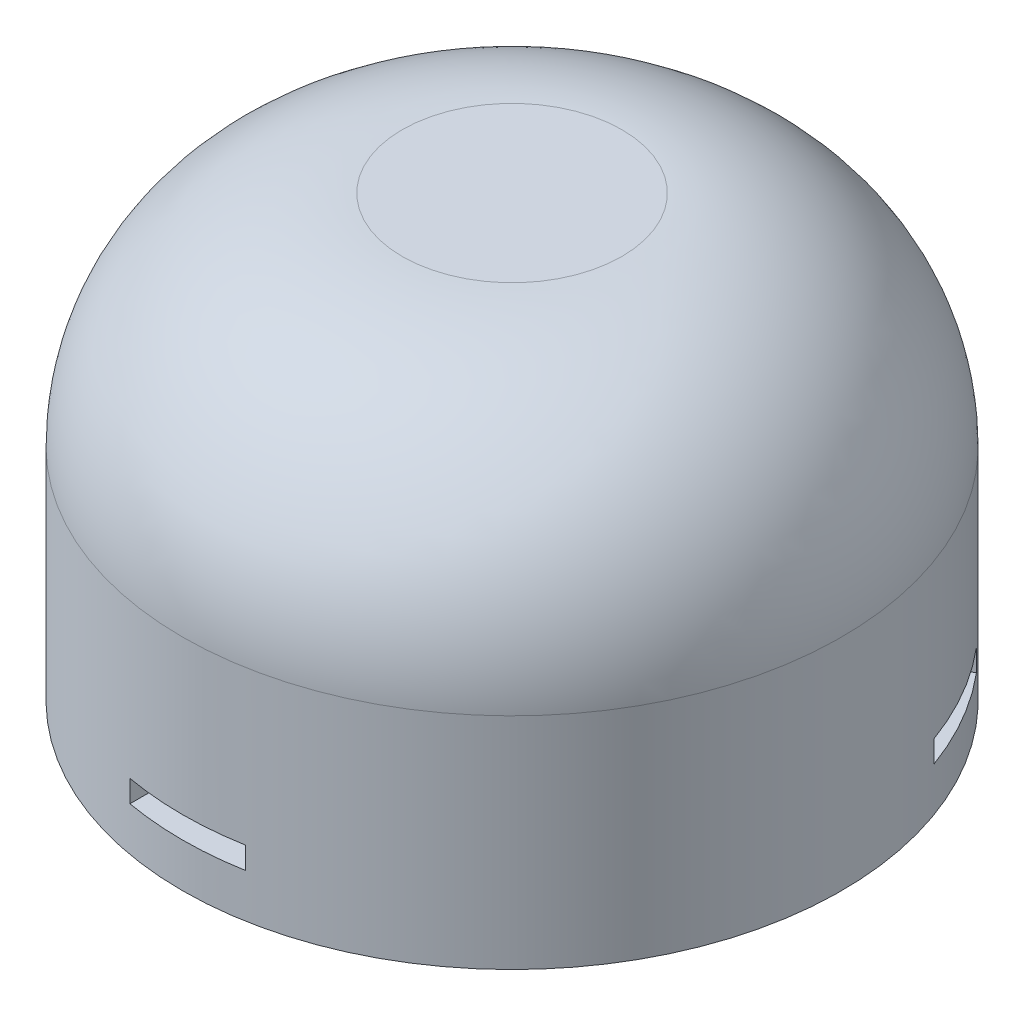
ISO-10303-21;
HEADER;
FILE_DESCRIPTION(('STEP AP214'),'2;1');
FILE_NAME('part.step','',(''),(''),'','','');
FILE_SCHEMA(('AUTOMOTIVE_DESIGN { 1 0 10303 214 1 1 1 1 }'));
ENDSEC;
DATA;
#1=APPLICATION_CONTEXT('core data for automotive mechanical design processes');
#2=APPLICATION_PROTOCOL_DEFINITION('international standard','automotive_design',2000,#1);
#3=PRODUCT_CONTEXT('',#1,'mechanical');
#4=PRODUCT('Part','Part','',(#3));
#5=PRODUCT_RELATED_PRODUCT_CATEGORY('part','',(#4));
#6=PRODUCT_DEFINITION_FORMATION('','',#4);
#7=PRODUCT_DEFINITION_CONTEXT('part definition',#1,'design');
#8=PRODUCT_DEFINITION('design','',#6,#7);
#9=PRODUCT_DEFINITION_SHAPE('','',#8);
#10=(LENGTH_UNIT() NAMED_UNIT(*) SI_UNIT(.MILLI.,.METRE.));
#11=(NAMED_UNIT(*) PLANE_ANGLE_UNIT() SI_UNIT($,.RADIAN.));
#12=(NAMED_UNIT(*) SI_UNIT($,.STERADIAN.) SOLID_ANGLE_UNIT());
#13=UNCERTAINTY_MEASURE_WITH_UNIT(LENGTH_MEASURE(1.E-05),#10,'distance_accuracy_value','');
#14=(GEOMETRIC_REPRESENTATION_CONTEXT(3) GLOBAL_UNCERTAINTY_ASSIGNED_CONTEXT((#13)) GLOBAL_UNIT_ASSIGNED_CONTEXT((#10,
#11,#12)) REPRESENTATION_CONTEXT('',''));
#15=CARTESIAN_POINT('',(0.,0.,0.));
#16=DIRECTION('',(0.,0.,1.));
#17=DIRECTION('',(1.,0.,0.));
#18=AXIS2_PLACEMENT_3D('',#15,#16,#17);
#19=CARTESIAN_POINT('',(0.,20.,0.));
#20=DIRECTION('',(0.,-1.,0.));
#21=DIRECTION('',(0.,0.,-1.));
#22=AXIS2_PLACEMENT_3D('',#19,#20,#21);
#23=CYLINDRICAL_SURFACE('',#22,15.);
#24=CARTESIAN_POINT('',(0.,2.,0.));
#25=DIRECTION('',(0.,-1.,0.));
#26=DIRECTION('',(0.,0.,-1.));
#27=AXIS2_PLACEMENT_3D('',#24,#25,#26);
#28=CIRCLE('',#27,15.);
#29=CARTESIAN_POINT('',(-14.1024191260148,2.,-5.11094656538412));
#30=VERTEX_POINT('',#29);
#31=CARTESIAN_POINT('',(-11.4774191260148,2.,-9.65757993525241));
#32=VERTEX_POINT('',#31);
#33=EDGE_CURVE('E277',#30,#32,#28,.T.);
#34=ORIENTED_EDGE('',*,*,#33,.T.);
#35=DIRECTION('',(0.,-1.,0.));
#36=VECTOR('',#35,1.);
#37=CARTESIAN_POINT('',(-11.4774191260148,20.,-9.65757993525241));
#38=LINE('',#37,#36);
#39=CARTESIAN_POINT('',(-11.4774191260148,3.,-9.65757993525241));
#40=VERTEX_POINT('',#39);
#41=EDGE_CURVE('E11',#32,#40,#38,.F.);
#42=ORIENTED_EDGE('',*,*,#41,.T.);
#43=CARTESIAN_POINT('',(0.,3.,0.));
#44=DIRECTION('',(0.,1.,0.));
#45=DIRECTION('',(0.,0.,1.));
#46=AXIS2_PLACEMENT_3D('',#43,#44,#45);
#47=CIRCLE('',#46,15.);
#48=CARTESIAN_POINT('',(-14.1024191260148,3.,-5.11094656538412));
#49=VERTEX_POINT('',#48);
#50=EDGE_CURVE('E54',#40,#49,#47,.T.);
#51=ORIENTED_EDGE('',*,*,#50,.T.);
#52=DIRECTION('',(0.,-1.,0.));
#53=VECTOR('',#52,1.);
#54=CARTESIAN_POINT('',(-14.1024191260148,20.,-5.11094656538412));
#55=LINE('',#54,#53);
#56=EDGE_CURVE('E280',#49,#30,#55,.T.);
#57=ORIENTED_EDGE('',*,*,#56,.T.);
#58=EDGE_LOOP('',(#34,#42,#51,#57));
#59=FACE_BOUND('',#58,.T.);
#60=CARTESIAN_POINT('',(0.,2.,0.));
#61=DIRECTION('',(0.,-1.,0.));
#62=DIRECTION('',(0.,0.,-1.));
#63=AXIS2_PLACEMENT_3D('',#60,#61,#62);
#64=CIRCLE('',#63,15.);
#65=CARTESIAN_POINT('',(11.4774191260149,2.,-9.65757993525225));
#66=VERTEX_POINT('',#65);
#67=CARTESIAN_POINT('',(14.1024191260149,2.,-5.11094656538392));
#68=VERTEX_POINT('',#67);
#69=EDGE_CURVE('E261',#66,#68,#64,.T.);
#70=ORIENTED_EDGE('',*,*,#69,.T.);
#71=DIRECTION('',(0.,-1.,0.));
#72=VECTOR('',#71,1.);
#73=CARTESIAN_POINT('',(14.1024191260149,20.,-5.11094656538392));
#74=LINE('',#73,#72);
#75=CARTESIAN_POINT('',(14.1024191260149,3.,-5.11094656538392));
#76=VERTEX_POINT('',#75);
#77=EDGE_CURVE('E273',#68,#76,#74,.F.);
#78=ORIENTED_EDGE('',*,*,#77,.T.);
#79=CARTESIAN_POINT('',(0.,3.,0.));
#80=DIRECTION('',(0.,1.,0.));
#81=DIRECTION('',(0.,0.,1.));
#82=AXIS2_PLACEMENT_3D('',#79,#80,#81);
#83=CIRCLE('',#82,15.);
#84=CARTESIAN_POINT('',(11.4774191260149,3.,-9.65757993525225));
#85=VERTEX_POINT('',#84);
#86=EDGE_CURVE('E269',#76,#85,#83,.T.);
#87=ORIENTED_EDGE('',*,*,#86,.T.);
#88=DIRECTION('',(0.,-1.,0.));
#89=VECTOR('',#88,1.);
#90=CARTESIAN_POINT('',(11.4774191260149,20.,-9.65757993525225));
#91=LINE('',#90,#89);
#92=EDGE_CURVE('E265',#85,#66,#91,.T.);
#93=ORIENTED_EDGE('',*,*,#92,.T.);
#94=EDGE_LOOP('',(#70,#78,#87,#93));
#95=FACE_BOUND('',#94,.T.);
#96=CARTESIAN_POINT('',(0.,2.,0.));
#97=DIRECTION('',(0.,-1.,0.));
#98=DIRECTION('',(1.,0.,0.));
#99=AXIS2_PLACEMENT_3D('',#96,#97,#98);
#100=CIRCLE('',#99,15.);
#101=CARTESIAN_POINT('',(2.625,2.,14.7685265006364));
#102=VERTEX_POINT('',#101);
#103=CARTESIAN_POINT('',(-2.625,2.,14.7685265006364));
#104=VERTEX_POINT('',#103);
#105=EDGE_CURVE('E245',#102,#104,#100,.T.);
#106=ORIENTED_EDGE('',*,*,#105,.T.);
#107=DIRECTION('',(0.,-1.,0.));
#108=VECTOR('',#107,1.);
#109=CARTESIAN_POINT('',(-2.625,20.,14.7685265006364));
#110=LINE('',#109,#108);
#111=CARTESIAN_POINT('',(-2.625,3.,14.7685265006364));
#112=VERTEX_POINT('',#111);
#113=EDGE_CURVE('E257',#104,#112,#110,.F.);
#114=ORIENTED_EDGE('',*,*,#113,.T.);
#115=CARTESIAN_POINT('',(0.,3.,0.));
#116=DIRECTION('',(0.,1.,0.));
#117=DIRECTION('',(-1.,0.,0.));
#118=AXIS2_PLACEMENT_3D('',#115,#116,#117);
#119=CIRCLE('',#118,15.);
#120=CARTESIAN_POINT('',(2.625,3.,14.7685265006364));
#121=VERTEX_POINT('',#120);
#122=EDGE_CURVE('E253',#112,#121,#119,.T.);
#123=ORIENTED_EDGE('',*,*,#122,.T.);
#124=DIRECTION('',(0.,-1.,0.));
#125=VECTOR('',#124,1.);
#126=CARTESIAN_POINT('',(2.625,20.,14.7685265006364));
#127=LINE('',#126,#125);
#128=EDGE_CURVE('E249',#121,#102,#127,.T.);
#129=ORIENTED_EDGE('',*,*,#128,.T.);
#130=EDGE_LOOP('',(#106,#114,#123,#129));
#131=FACE_BOUND('',#130,.T.);
#132=CARTESIAN_POINT('',(0.,10.,0.));
#133=DIRECTION('',(0.,1.,0.));
#134=DIRECTION('',(0.,0.,1.));
#135=AXIS2_PLACEMENT_3D('',#132,#133,#134);
#136=CIRCLE('',#135,15.);
#137=CARTESIAN_POINT('',(0.,10.,15.));
#138=VERTEX_POINT('',#137);
#139=EDGE_CURVE('E241',#138,#138,#136,.F.);
#140=ORIENTED_EDGE('',*,*,#139,.T.);
#141=EDGE_LOOP('',(#140));
#142=FACE_BOUND('',#141,.T.);
#143=CARTESIAN_POINT('',(0.,0.,0.));
#144=DIRECTION('',(0.,1.,0.));
#145=DIRECTION('',(0.,0.,1.));
#146=AXIS2_PLACEMENT_3D('',#143,#144,#145);
#147=CIRCLE('',#146,15.);
#148=CARTESIAN_POINT('',(0.,0.,15.));
#149=VERTEX_POINT('',#148);
#150=EDGE_CURVE('E223',#149,#149,#147,.T.);
#151=ORIENTED_EDGE('',*,*,#150,.T.);
#152=EDGE_LOOP('',(#151));
#153=FACE_BOUND('',#152,.T.);
#154=ADVANCED_FACE('F45',(#59,#95,#131,#142,#153),#23,.T.);
#155=CARTESIAN_POINT('',(0.,20.,0.));
#156=DIRECTION('',(0.,1.,0.));
#157=DIRECTION('',(0.,0.,1.));
#158=AXIS2_PLACEMENT_3D('',#155,#156,#157);
#159=PLANE('',#158);
#160=CARTESIAN_POINT('',(0.,20.,0.));
#161=DIRECTION('',(0.,1.,0.));
#162=DIRECTION('',(0.,0.,1.));
#163=AXIS2_PLACEMENT_3D('',#160,#161,#162);
#164=CIRCLE('',#163,5.);
#165=CARTESIAN_POINT('',(0.,20.,5.));
#166=VERTEX_POINT('',#165);
#167=EDGE_CURVE('E237',#166,#166,#164,.T.);
#168=ORIENTED_EDGE('',*,*,#167,.T.);
#169=EDGE_LOOP('',(#168));
#170=FACE_BOUND('',#169,.T.);
#171=ADVANCED_FACE('F300',(#170),#159,.T.);
#172=CARTESIAN_POINT('',(0.,0.,0.));
#173=DIRECTION('',(0.,1.,0.));
#174=DIRECTION('',(0.,0.,1.));
#175=AXIS2_PLACEMENT_3D('',#172,#173,#174);
#176=PLANE('',#175);
#177=ORIENTED_EDGE('',*,*,#150,.F.);
#178=EDGE_LOOP('',(#177));
#179=FACE_BOUND('',#178,.T.);
#180=ADVANCED_FACE('F306',(#179),#176,.F.);
#181=CARTESIAN_POINT('',(0.,10.,0.));
#182=DIRECTION('',(0.,1.,0.));
#183=DIRECTION('',(0.,0.,1.));
#184=AXIS2_PLACEMENT_3D('',#181,#182,#183);
#185=DEGENERATE_TOROIDAL_SURFACE('',#184,5.,10.,.T.);
#186=ORIENTED_EDGE('',*,*,#139,.F.);
#187=EDGE_LOOP('',(#186));
#188=FACE_BOUND('',#187,.T.);
#189=ORIENTED_EDGE('',*,*,#167,.F.);
#190=EDGE_LOOP('',(#189));
#191=FACE_BOUND('',#190,.T.);
#192=ADVANCED_FACE('F47',(#188,#191),#185,.T.);
#193=CARTESIAN_POINT('',(-2.625,2.,10.));
#194=DIRECTION('',(-1.,0.,0.));
#195=DIRECTION('',(0.,0.,1.));
#196=AXIS2_PLACEMENT_3D('',#193,#194,#195);
#197=PLANE('',#196);
#198=DIRECTION('',(0.,0.,1.));
#199=VECTOR('',#198,1.);
#200=CARTESIAN_POINT('',(-2.625,2.,10.));
#201=LINE('',#200,#199);
#202=CARTESIAN_POINT('',(-2.625,2.,10.));
#203=VERTEX_POINT('',#202);
#204=EDGE_CURVE('E218',#203,#104,#201,.T.);
#205=ORIENTED_EDGE('',*,*,#204,.F.);
#206=DIRECTION('',(0.,-1.,0.));
#207=VECTOR('',#206,1.);
#208=CARTESIAN_POINT('',(-2.625,2.,10.));
#209=LINE('',#208,#207);
#210=CARTESIAN_POINT('',(-2.625,3.,10.));
#211=VERTEX_POINT('',#210);
#212=EDGE_CURVE('E171',#211,#203,#209,.T.);
#213=ORIENTED_EDGE('',*,*,#212,.F.);
#214=DIRECTION('',(0.,0.,1.));
#215=VECTOR('',#214,1.);
#216=CARTESIAN_POINT('',(-2.625,3.,10.));
#217=LINE('',#216,#215);
#218=EDGE_CURVE('E219',#211,#112,#217,.T.);
#219=ORIENTED_EDGE('',*,*,#218,.T.);
#220=ORIENTED_EDGE('',*,*,#113,.F.);
#221=EDGE_LOOP('',(#205,#213,#219,#220));
#222=FACE_BOUND('',#221,.T.);
#223=ADVANCED_FACE('F313',(#222),#197,.F.);
#224=CARTESIAN_POINT('',(-2.625,3.,10.));
#225=DIRECTION('',(0.,1.,0.));
#226=DIRECTION('',(-1.,0.,0.));
#227=AXIS2_PLACEMENT_3D('',#224,#225,#226);
#228=PLANE('',#227);
#229=ORIENTED_EDGE('',*,*,#218,.F.);
#230=DIRECTION('',(-1.,0.,0.));
#231=VECTOR('',#230,1.);
#232=CARTESIAN_POINT('',(-2.625,3.,10.));
#233=LINE('',#232,#231);
#234=CARTESIAN_POINT('',(2.625,3.,10.));
#235=VERTEX_POINT('',#234);
#236=EDGE_CURVE('E214',#235,#211,#233,.T.);
#237=ORIENTED_EDGE('',*,*,#236,.F.);
#238=DIRECTION('',(0.,0.,1.));
#239=VECTOR('',#238,1.);
#240=CARTESIAN_POINT('',(2.625,3.,10.));
#241=LINE('',#240,#239);
#242=EDGE_CURVE('E224',#235,#121,#241,.T.);
#243=ORIENTED_EDGE('',*,*,#242,.T.);
#244=ORIENTED_EDGE('',*,*,#122,.F.);
#245=EDGE_LOOP('',(#229,#237,#243,#244));
#246=FACE_BOUND('',#245,.T.);
#247=ADVANCED_FACE('F316',(#246),#228,.F.);
#248=CARTESIAN_POINT('',(2.625,2.,10.));
#249=DIRECTION('',(1.,0.,0.));
#250=DIRECTION('',(0.,0.,-1.));
#251=AXIS2_PLACEMENT_3D('',#248,#249,#250);
#252=PLANE('',#251);
#253=ORIENTED_EDGE('',*,*,#242,.F.);
#254=DIRECTION('',(0.,1.,0.));
#255=VECTOR('',#254,1.);
#256=CARTESIAN_POINT('',(2.625,2.,10.));
#257=LINE('',#256,#255);
#258=CARTESIAN_POINT('',(2.625,2.,10.));
#259=VERTEX_POINT('',#258);
#260=EDGE_CURVE('E210',#259,#235,#257,.T.);
#261=ORIENTED_EDGE('',*,*,#260,.F.);
#262=DIRECTION('',(0.,0.,1.));
#263=VECTOR('',#262,1.);
#264=CARTESIAN_POINT('',(2.625,2.,10.));
#265=LINE('',#264,#263);
#266=EDGE_CURVE('E228',#259,#102,#265,.T.);
#267=ORIENTED_EDGE('',*,*,#266,.T.);
#268=ORIENTED_EDGE('',*,*,#128,.F.);
#269=EDGE_LOOP('',(#253,#261,#267,#268));
#270=FACE_BOUND('',#269,.T.);
#271=ADVANCED_FACE('F322',(#270),#252,.F.);
#272=CARTESIAN_POINT('',(-2.625,2.,10.));
#273=DIRECTION('',(0.,-1.,0.));
#274=DIRECTION('',(1.,0.,0.));
#275=AXIS2_PLACEMENT_3D('',#272,#273,#274);
#276=PLANE('',#275);
#277=ORIENTED_EDGE('',*,*,#266,.F.);
#278=DIRECTION('',(1.,0.,0.));
#279=VECTOR('',#278,1.);
#280=CARTESIAN_POINT('',(-2.625,2.,10.));
#281=LINE('',#280,#279);
#282=EDGE_CURVE('E206',#203,#259,#281,.T.);
#283=ORIENTED_EDGE('',*,*,#282,.F.);
#284=ORIENTED_EDGE('',*,*,#204,.T.);
#285=ORIENTED_EDGE('',*,*,#105,.F.);
#286=EDGE_LOOP('',(#277,#283,#284,#285));
#287=FACE_BOUND('',#286,.T.);
#288=ADVANCED_FACE('F318',(#287),#276,.F.);
#289=CARTESIAN_POINT('',(0.,0.,10.));
#290=DIRECTION('',(0.,0.,-1.));
#291=DIRECTION('',(-1.,0.,0.));
#292=AXIS2_PLACEMENT_3D('',#289,#290,#291);
#293=PLANE('',#292);
#294=ORIENTED_EDGE('',*,*,#212,.T.);
#295=ORIENTED_EDGE('',*,*,#282,.T.);
#296=ORIENTED_EDGE('',*,*,#260,.T.);
#297=ORIENTED_EDGE('',*,*,#236,.T.);
#298=EDGE_LOOP('',(#294,#295,#296,#297));
#299=FACE_BOUND('',#298,.T.);
#300=ADVANCED_FACE('F321',(#299),#293,.F.);
#301=CARTESIAN_POINT('',(9.97275403784442,2.,-2.72668331506576));
#302=DIRECTION('',(0.499999999999992,0.,0.866025403784443));
#303=DIRECTION('',(0.866025403784443,0.,-0.499999999999992));
#304=AXIS2_PLACEMENT_3D('',#301,#302,#303);
#305=PLANE('',#304);
#306=DIRECTION('',(0.866025403784443,0.,-0.499999999999992));
#307=VECTOR('',#306,1.);
#308=CARTESIAN_POINT('',(9.97275403784442,2.,-2.72668331506576));
#309=LINE('',#308,#307);
#310=CARTESIAN_POINT('',(9.97275403784442,2.,-2.72668331506576));
#311=VERTEX_POINT('',#310);
#312=EDGE_CURVE('E69',#311,#68,#309,.T.);
#313=ORIENTED_EDGE('',*,*,#312,.F.);
#314=DIRECTION('',(0.,-1.,0.));
#315=VECTOR('',#314,1.);
#316=CARTESIAN_POINT('',(9.97275403784442,2.,-2.72668331506576));
#317=LINE('',#316,#315);
#318=CARTESIAN_POINT('',(9.97275403784442,3.,-2.72668331506576));
#319=VERTEX_POINT('',#318);
#320=EDGE_CURVE('E178',#319,#311,#317,.T.);
#321=ORIENTED_EDGE('',*,*,#320,.F.);
#322=DIRECTION('',(0.866025403784443,0.,-0.499999999999992));
#323=VECTOR('',#322,1.);
#324=CARTESIAN_POINT('',(9.97275403784442,3.,-2.72668331506576));
#325=LINE('',#324,#323);
#326=EDGE_CURVE('E157',#319,#76,#325,.T.);
#327=ORIENTED_EDGE('',*,*,#326,.T.);
#328=ORIENTED_EDGE('',*,*,#77,.F.);
#329=EDGE_LOOP('',(#313,#321,#327,#328));
#330=FACE_BOUND('',#329,.T.);
#331=ADVANCED_FACE('F331',(#330),#305,.F.);
#332=CARTESIAN_POINT('',(9.97275403784442,3.,-2.72668331506576));
#333=DIRECTION('',(0.,1.,0.));
#334=DIRECTION('',(0.,0.,1.));
#335=AXIS2_PLACEMENT_3D('',#332,#333,#334);
#336=PLANE('',#335);
#337=ORIENTED_EDGE('',*,*,#326,.F.);
#338=DIRECTION('',(0.499999999999992,0.,0.866025403784443));
#339=VECTOR('',#338,1.);
#340=CARTESIAN_POINT('',(9.97275403784442,3.,-2.72668331506576));
#341=LINE('',#340,#339);
#342=CARTESIAN_POINT('',(7.34775403784445,3.,-7.27331668493408));
#343=VERTEX_POINT('',#342);
#344=EDGE_CURVE('E190',#343,#319,#341,.T.);
#345=ORIENTED_EDGE('',*,*,#344,.F.);
#346=DIRECTION('',(0.866025403784443,0.,-0.499999999999992));
#347=VECTOR('',#346,1.);
#348=CARTESIAN_POINT('',(7.34775403784445,3.,-7.27331668493408));
#349=LINE('',#348,#347);
#350=EDGE_CURVE('E161',#343,#85,#349,.T.);
#351=ORIENTED_EDGE('',*,*,#350,.T.);
#352=ORIENTED_EDGE('',*,*,#86,.F.);
#353=EDGE_LOOP('',(#337,#345,#351,#352));
#354=FACE_BOUND('',#353,.T.);
#355=ADVANCED_FACE('F334',(#354),#336,.F.);
#356=CARTESIAN_POINT('',(7.34775403784445,2.,-7.27331668493408));
#357=DIRECTION('',(-0.499999999999992,0.,-0.866025403784443));
#358=DIRECTION('',(-0.866025403784443,0.,0.499999999999992));
#359=AXIS2_PLACEMENT_3D('',#356,#357,#358);
#360=PLANE('',#359);
#361=ORIENTED_EDGE('',*,*,#350,.F.);
#362=DIRECTION('',(0.,1.,0.));
#363=VECTOR('',#362,1.);
#364=CARTESIAN_POINT('',(7.34775403784445,2.,-7.27331668493408));
#365=LINE('',#364,#363);
#366=CARTESIAN_POINT('',(7.34775403784445,2.,-7.27331668493408));
#367=VERTEX_POINT('',#366);
#368=EDGE_CURVE('E186',#367,#343,#365,.T.);
#369=ORIENTED_EDGE('',*,*,#368,.F.);
#370=DIRECTION('',(0.866025403784443,0.,-0.499999999999992));
#371=VECTOR('',#370,1.);
#372=CARTESIAN_POINT('',(7.34775403784445,2.,-7.27331668493408));
#373=LINE('',#372,#371);
#374=EDGE_CURVE('E197',#367,#66,#373,.T.);
#375=ORIENTED_EDGE('',*,*,#374,.T.);
#376=ORIENTED_EDGE('',*,*,#92,.F.);
#377=EDGE_LOOP('',(#361,#369,#375,#376));
#378=FACE_BOUND('',#377,.T.);
#379=ADVANCED_FACE('F340',(#378),#360,.F.);
#380=CARTESIAN_POINT('',(9.97275403784442,2.,-2.72668331506576));
#381=DIRECTION('',(0.,-1.,0.));
#382=DIRECTION('',(0.,0.,-1.));
#383=AXIS2_PLACEMENT_3D('',#380,#381,#382);
#384=PLANE('',#383);
#385=ORIENTED_EDGE('',*,*,#374,.F.);
#386=DIRECTION('',(-0.499999999999992,0.,-0.866025403784443));
#387=VECTOR('',#386,1.);
#388=CARTESIAN_POINT('',(9.97275403784442,2.,-2.72668331506576));
#389=LINE('',#388,#387);
#390=EDGE_CURVE('E182',#311,#367,#389,.T.);
#391=ORIENTED_EDGE('',*,*,#390,.F.);
#392=ORIENTED_EDGE('',*,*,#312,.T.);
#393=ORIENTED_EDGE('',*,*,#69,.F.);
#394=EDGE_LOOP('',(#385,#391,#392,#393));
#395=FACE_BOUND('',#394,.T.);
#396=ADVANCED_FACE('F336',(#395),#384,.F.);
#397=CARTESIAN_POINT('',(8.66025403784444,0.,-4.99999999999992));
#398=DIRECTION('',(-0.866025403784443,0.,0.499999999999992));
#399=DIRECTION('',(0.499999999999992,0.,0.866025403784443));
#400=AXIS2_PLACEMENT_3D('',#397,#398,#399);
#401=PLANE('',#400);
#402=ORIENTED_EDGE('',*,*,#320,.T.);
#403=ORIENTED_EDGE('',*,*,#390,.T.);
#404=ORIENTED_EDGE('',*,*,#368,.T.);
#405=ORIENTED_EDGE('',*,*,#344,.T.);
#406=EDGE_LOOP('',(#402,#403,#404,#405));
#407=FACE_BOUND('',#406,.T.);
#408=ADVANCED_FACE('F339',(#407),#401,.F.);
#409=CARTESIAN_POINT('',(-7.34775403784435,2.,-7.27331668493419));
#410=DIRECTION('',(0.500000000000004,0.,-0.866025403784436));
#411=DIRECTION('',(-0.866025403784436,0.,-0.500000000000004));
#412=AXIS2_PLACEMENT_3D('',#409,#410,#411);
#413=PLANE('',#412);
#414=DIRECTION('',(-0.866025403784436,0.,-0.500000000000004));
#415=VECTOR('',#414,1.);
#416=CARTESIAN_POINT('',(-7.34775403784435,2.,-7.27331668493419));
#417=LINE('',#416,#415);
#418=CARTESIAN_POINT('',(-7.34775403784435,2.,-7.27331668493419));
#419=VERTEX_POINT('',#418);
#420=EDGE_CURVE('E61',#419,#32,#417,.T.);
#421=ORIENTED_EDGE('',*,*,#420,.F.);
#422=DIRECTION('',(0.,-1.,0.));
#423=VECTOR('',#422,1.);
#424=CARTESIAN_POINT('',(-7.34775403784435,2.,-7.27331668493419));
#425=LINE('',#424,#423);
#426=CARTESIAN_POINT('',(-7.34775403784435,3.,-7.27331668493419));
#427=VERTEX_POINT('',#426);
#428=EDGE_CURVE('E137',#427,#419,#425,.T.);
#429=ORIENTED_EDGE('',*,*,#428,.F.);
#430=DIRECTION('',(-0.866025403784436,0.,-0.500000000000004));
#431=VECTOR('',#430,1.);
#432=CARTESIAN_POINT('',(-7.34775403784435,3.,-7.27331668493419));
#433=LINE('',#432,#431);
#434=EDGE_CURVE('E168',#427,#40,#433,.T.);
#435=ORIENTED_EDGE('',*,*,#434,.T.);
#436=ORIENTED_EDGE('',*,*,#41,.F.);
#437=EDGE_LOOP('',(#421,#429,#435,#436));
#438=FACE_BOUND('',#437,.T.);
#439=ADVANCED_FACE('F134',(#438),#413,.F.);
#440=CARTESIAN_POINT('',(-7.34775403784435,3.,-7.27331668493419));
#441=DIRECTION('',(0.,1.,0.));
#442=DIRECTION('',(0.,0.,1.));
#443=AXIS2_PLACEMENT_3D('',#440,#441,#442);
#444=PLANE('',#443);
#445=ORIENTED_EDGE('',*,*,#434,.F.);
#446=DIRECTION('',(0.500000000000004,0.,-0.866025403784436));
#447=VECTOR('',#446,1.);
#448=CARTESIAN_POINT('',(-7.34775403784435,3.,-7.27331668493419));
#449=LINE('',#448,#447);
#450=CARTESIAN_POINT('',(-9.97275403784437,3.,-2.7266833150659));
#451=VERTEX_POINT('',#450);
#452=EDGE_CURVE('E142',#451,#427,#449,.T.);
#453=ORIENTED_EDGE('',*,*,#452,.F.);
#454=DIRECTION('',(-0.866025403784436,0.,-0.500000000000004));
#455=VECTOR('',#454,1.);
#456=CARTESIAN_POINT('',(-9.97275403784437,3.,-2.7266833150659));
#457=LINE('',#456,#455);
#458=EDGE_CURVE('E172',#451,#49,#457,.T.);
#459=ORIENTED_EDGE('',*,*,#458,.T.);
#460=ORIENTED_EDGE('',*,*,#50,.F.);
#461=EDGE_LOOP('',(#445,#453,#459,#460));
#462=FACE_BOUND('',#461,.T.);
#463=ADVANCED_FACE('F288',(#462),#444,.F.);
#464=CARTESIAN_POINT('',(-9.97275403784437,2.,-2.7266833150659));
#465=DIRECTION('',(-0.500000000000004,0.,0.866025403784436));
#466=DIRECTION('',(0.866025403784436,0.,0.500000000000004));
#467=AXIS2_PLACEMENT_3D('',#464,#465,#466);
#468=PLANE('',#467);
#469=ORIENTED_EDGE('',*,*,#458,.F.);
#470=DIRECTION('',(0.,1.,0.));
#471=VECTOR('',#470,1.);
#472=CARTESIAN_POINT('',(-9.97275403784437,2.,-2.7266833150659));
#473=LINE('',#472,#471);
#474=CARTESIAN_POINT('',(-9.97275403784437,2.,-2.7266833150659));
#475=VERTEX_POINT('',#474);
#476=EDGE_CURVE('E152',#475,#451,#473,.T.);
#477=ORIENTED_EDGE('',*,*,#476,.F.);
#478=DIRECTION('',(-0.866025403784436,0.,-0.500000000000004));
#479=VECTOR('',#478,1.);
#480=CARTESIAN_POINT('',(-9.97275403784437,2.,-2.7266833150659));
#481=LINE('',#480,#479);
#482=EDGE_CURVE('E141',#475,#30,#481,.T.);
#483=ORIENTED_EDGE('',*,*,#482,.T.);
#484=ORIENTED_EDGE('',*,*,#56,.F.);
#485=EDGE_LOOP('',(#469,#477,#483,#484));
#486=FACE_BOUND('',#485,.T.);
#487=ADVANCED_FACE('F290',(#486),#468,.F.);
#488=CARTESIAN_POINT('',(-7.34775403784435,2.,-7.27331668493419));
#489=DIRECTION('',(0.,-1.,0.));
#490=DIRECTION('',(0.,0.,-1.));
#491=AXIS2_PLACEMENT_3D('',#488,#489,#490);
#492=PLANE('',#491);
#493=ORIENTED_EDGE('',*,*,#482,.F.);
#494=DIRECTION('',(-0.500000000000004,0.,0.866025403784436));
#495=VECTOR('',#494,1.);
#496=CARTESIAN_POINT('',(-7.34775403784435,2.,-7.27331668493419));
#497=LINE('',#496,#495);
#498=EDGE_CURVE('E145',#419,#475,#497,.T.);
#499=ORIENTED_EDGE('',*,*,#498,.F.);
#500=ORIENTED_EDGE('',*,*,#420,.T.);
#501=ORIENTED_EDGE('',*,*,#33,.F.);
#502=EDGE_LOOP('',(#493,#499,#500,#501));
#503=FACE_BOUND('',#502,.T.);
#504=ADVANCED_FACE('F146',(#503),#492,.F.);
#505=CARTESIAN_POINT('',(-8.66025403784436,0.,-5.00000000000004));
#506=DIRECTION('',(0.866025403784436,0.,0.500000000000004));
#507=DIRECTION('',(0.500000000000004,0.,-0.866025403784436));
#508=AXIS2_PLACEMENT_3D('',#505,#506,#507);
#509=PLANE('',#508);
#510=ORIENTED_EDGE('',*,*,#428,.T.);
#511=ORIENTED_EDGE('',*,*,#498,.T.);
#512=ORIENTED_EDGE('',*,*,#476,.T.);
#513=ORIENTED_EDGE('',*,*,#452,.T.);
#514=EDGE_LOOP('',(#510,#511,#512,#513));
#515=FACE_BOUND('',#514,.T.);
#516=ADVANCED_FACE('F154',(#515),#509,.F.);
#517=CLOSED_SHELL('',(#154,#171,#180,#192,#223,#247,#271,#288,#300,#331,#355,#379,#396,#408,
#439,#463,#487,#504,#516));
#518=MANIFOLD_SOLID_BREP('B2',#517);
#519=ADVANCED_BREP_SHAPE_REPRESENTATION('',(#18,#518),#14);
#520=SHAPE_DEFINITION_REPRESENTATION(#9,#519);
ENDSEC;
END-ISO-10303-21;
